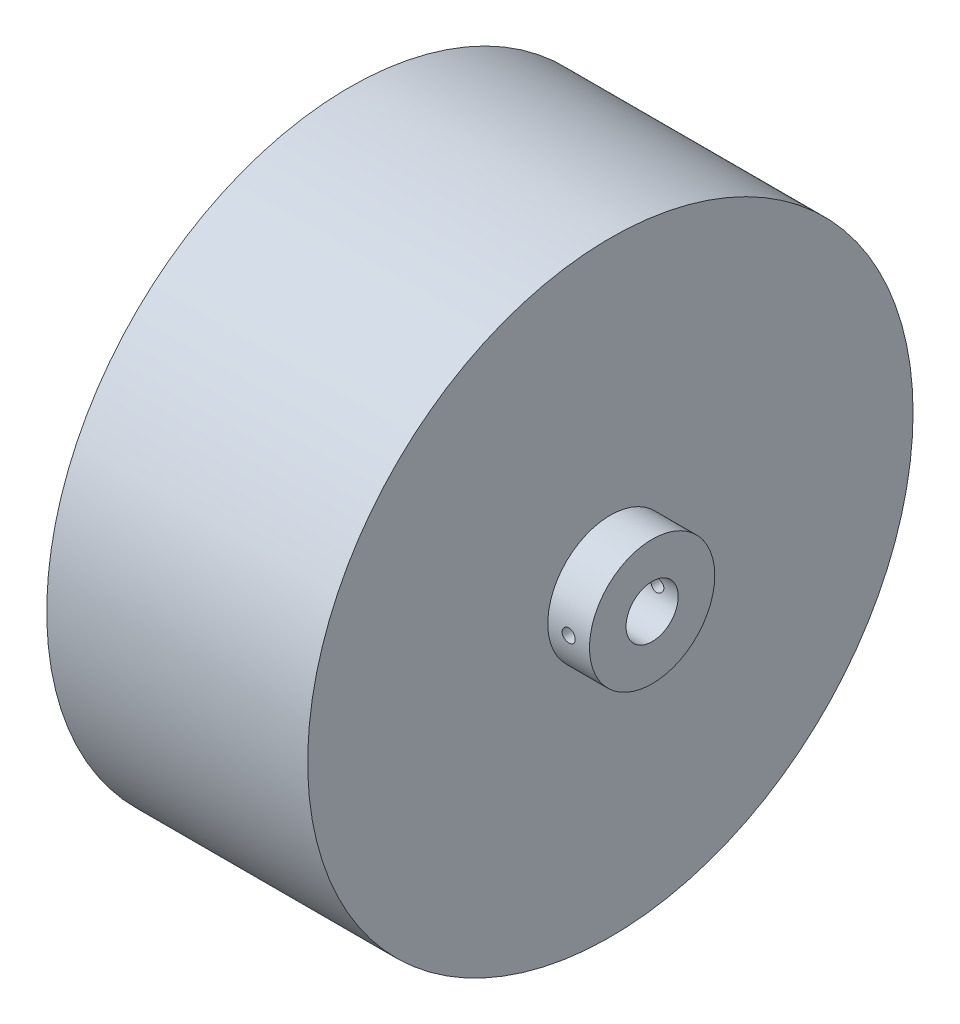
ISO-10303-21;
HEADER;
FILE_DESCRIPTION(('STEP AP214'),'2;1');
FILE_NAME('part.step','',(''),(''),'','','');
FILE_SCHEMA(('AUTOMOTIVE_DESIGN { 1 0 10303 214 1 1 1 1 }'));
ENDSEC;
DATA;
#1=APPLICATION_CONTEXT('core data for automotive mechanical design processes');
#2=APPLICATION_PROTOCOL_DEFINITION('international standard','automotive_design',2000,#1);
#3=PRODUCT_CONTEXT('',#1,'mechanical');
#4=PRODUCT('Part','Part','',(#3));
#5=PRODUCT_RELATED_PRODUCT_CATEGORY('part','',(#4));
#6=PRODUCT_DEFINITION_FORMATION('','',#4);
#7=PRODUCT_DEFINITION_CONTEXT('part definition',#1,'design');
#8=PRODUCT_DEFINITION('design','',#6,#7);
#9=PRODUCT_DEFINITION_SHAPE('','',#8);
#10=(LENGTH_UNIT() NAMED_UNIT(*) SI_UNIT(.MILLI.,.METRE.));
#11=(NAMED_UNIT(*) PLANE_ANGLE_UNIT() SI_UNIT($,.RADIAN.));
#12=(NAMED_UNIT(*) SI_UNIT($,.STERADIAN.) SOLID_ANGLE_UNIT());
#13=UNCERTAINTY_MEASURE_WITH_UNIT(LENGTH_MEASURE(1.E-05),#10,'distance_accuracy_value','');
#14=(GEOMETRIC_REPRESENTATION_CONTEXT(3) GLOBAL_UNCERTAINTY_ASSIGNED_CONTEXT((#13)) GLOBAL_UNIT_ASSIGNED_CONTEXT((#10,
#11,#12)) REPRESENTATION_CONTEXT('',''));
#15=CARTESIAN_POINT('',(0.,0.,0.));
#16=DIRECTION('',(0.,0.,1.));
#17=DIRECTION('',(1.,0.,0.));
#18=AXIS2_PLACEMENT_3D('',#15,#16,#17);
#19=CARTESIAN_POINT('',(31.75,0.,0.));
#20=DIRECTION('',(-1.,0.,0.));
#21=DIRECTION('',(0.,0.,1.));
#22=AXIS2_PLACEMENT_3D('',#19,#20,#21);
#23=CYLINDRICAL_SURFACE('',#22,36.83);
#24=CARTESIAN_POINT('',(31.75,0.,0.));
#25=DIRECTION('',(1.,0.,0.));
#26=DIRECTION('',(0.,0.,-1.));
#27=AXIS2_PLACEMENT_3D('',#24,#25,#26);
#28=CIRCLE('',#27,36.83);
#29=CARTESIAN_POINT('',(31.75,0.,-36.83));
#30=VERTEX_POINT('',#29);
#31=EDGE_CURVE('E45',#30,#30,#28,.T.);
#32=ORIENTED_EDGE('',*,*,#31,.F.);
#33=EDGE_LOOP('',(#32));
#34=FACE_BOUND('',#33,.T.);
#35=CARTESIAN_POINT('',(0.,0.,0.));
#36=DIRECTION('',(1.,0.,0.));
#37=DIRECTION('',(0.,0.,-1.));
#38=AXIS2_PLACEMENT_3D('',#35,#36,#37);
#39=CIRCLE('',#38,36.83);
#40=CARTESIAN_POINT('',(0.,0.,-36.83));
#41=VERTEX_POINT('',#40);
#42=EDGE_CURVE('E51',#41,#41,#39,.T.);
#43=ORIENTED_EDGE('',*,*,#42,.T.);
#44=EDGE_LOOP('',(#43));
#45=FACE_BOUND('',#44,.T.);
#46=ADVANCED_FACE('F37',(#34,#45),#23,.T.);
#47=CARTESIAN_POINT('',(31.75,0.,0.));
#48=DIRECTION('',(1.,0.,0.));
#49=DIRECTION('',(0.,0.,-1.));
#50=AXIS2_PLACEMENT_3D('',#47,#48,#49);
#51=PLANE('',#50);
#52=CARTESIAN_POINT('',(31.75,0.,0.));
#53=DIRECTION('',(1.,0.,0.));
#54=DIRECTION('',(0.,0.,-1.));
#55=AXIS2_PLACEMENT_3D('',#52,#53,#54);
#56=CIRCLE('',#55,7.62);
#57=CARTESIAN_POINT('',(31.75,0.,-7.62));
#58=VERTEX_POINT('',#57);
#59=EDGE_CURVE('E10',#58,#58,#56,.T.);
#60=ORIENTED_EDGE('',*,*,#59,.F.);
#61=EDGE_LOOP('',(#60));
#62=FACE_BOUND('',#61,.T.);
#63=ORIENTED_EDGE('',*,*,#31,.T.);
#64=EDGE_LOOP('',(#63));
#65=FACE_BOUND('',#64,.T.);
#66=ADVANCED_FACE('F103',(#62,#65),#51,.T.);
#67=CARTESIAN_POINT('',(0.,0.,0.));
#68=DIRECTION('',(1.,0.,0.));
#69=DIRECTION('',(0.,0.,-1.));
#70=AXIS2_PLACEMENT_3D('',#67,#68,#69);
#71=PLANE('',#70);
#72=ORIENTED_EDGE('',*,*,#42,.F.);
#73=EDGE_LOOP('',(#72));
#74=FACE_BOUND('',#73,.T.);
#75=CARTESIAN_POINT('',(0.,0.,0.));
#76=DIRECTION('',(1.,0.,0.));
#77=DIRECTION('',(0.,0.,-1.));
#78=AXIS2_PLACEMENT_3D('',#75,#76,#77);
#79=CIRCLE('',#78,3.175);
#80=CARTESIAN_POINT('',(0.,0.,-3.175));
#81=VERTEX_POINT('',#80);
#82=EDGE_CURVE('E40',#81,#81,#79,.F.);
#83=ORIENTED_EDGE('',*,*,#82,.F.);
#84=EDGE_LOOP('',(#83));
#85=FACE_BOUND('',#84,.T.);
#86=ADVANCED_FACE('F101',(#74,#85),#71,.F.);
#87=CARTESIAN_POINT('',(36.83,0.,0.));
#88=DIRECTION('',(-1.,0.,0.));
#89=DIRECTION('',(0.,0.,1.));
#90=AXIS2_PLACEMENT_3D('',#87,#88,#89);
#91=CYLINDRICAL_SURFACE('',#90,7.62);
#92=CARTESIAN_POINT('',(35.08375,0.,7.62));
#93=CARTESIAN_POINT('',(35.0837480798996,-0.0444560639248586,7.61999946932234));
#94=CARTESIAN_POINT('',(35.0800026038926,-0.0889412765303827,7.61960682623201));
#95=CARTESIAN_POINT('',(35.0651180983999,-0.176677706388215,7.61807825280323));
#96=CARTESIAN_POINT('',(35.0539709876366,-0.219927520910524,7.61694151005866));
#97=CARTESIAN_POINT('',(35.0246118467081,-0.303909992329884,7.61405301623396));
#98=CARTESIAN_POINT('',(35.0064041578639,-0.344644178198427,7.61230164313289));
#99=CARTESIAN_POINT('',(34.9634493075109,-0.422469629984459,7.60837956384624));
#100=CARTESIAN_POINT('',(34.9387034191763,-0.459561603218021,7.60620893932301));
#101=CARTESIAN_POINT('',(34.8832714224455,-0.529202658664446,7.60168194874707));
#102=CARTESIAN_POINT('',(34.8525650589263,-0.561735579913695,7.59932496606751));
#103=CARTESIAN_POINT('',(34.7861270161831,-0.621196091870419,7.59469598502292));
#104=CARTESIAN_POINT('',(34.7503951012427,-0.648123419508548,7.59242399065049));
#105=CARTESIAN_POINT('',(34.6748184421033,-0.695666119900658,7.58821597236895));
#106=CARTESIAN_POINT('',(34.634964395797,-0.716266781165265,7.58628073598548));
#107=CARTESIAN_POINT('',(34.5523391992154,-0.750477434262916,7.58297308247649));
#108=CARTESIAN_POINT('',(34.5095681268174,-0.764087612641532,7.58160065033237));
#109=CARTESIAN_POINT('',(34.4224883375713,-0.783882840087457,7.57957962928899));
#110=CARTESIAN_POINT('',(34.3781857954807,-0.79009478000049,7.57892841952593));
#111=CARTESIAN_POINT('',(34.2891625263454,-0.795000334079435,7.57841546003468));
#112=CARTESIAN_POINT('',(34.2444418112061,-0.793694161638182,7.57855368789922));
#113=CARTESIAN_POINT('',(34.1560373268632,-0.783622718419292,7.57960159121397));
#114=CARTESIAN_POINT('',(34.112350167142,-0.774886847786491,7.58050822594359));
#115=CARTESIAN_POINT('',(34.0270654475717,-0.750249752470821,7.58298604000664));
#116=CARTESIAN_POINT('',(33.9854679181172,-0.734348423596064,7.58455722900324));
#117=CARTESIAN_POINT('',(33.905450619836,-0.695799469539271,7.58819061039154));
#118=CARTESIAN_POINT('',(33.8670371600334,-0.673138841189195,7.59025374761745));
#119=CARTESIAN_POINT('',(33.7945474708059,-0.621723877286324,7.59463777461122));
#120=CARTESIAN_POINT('',(33.7604713792306,-0.592969348135541,7.59695867256681));
#121=CARTESIAN_POINT('',(33.6974529076501,-0.5300188033957,7.60161026044644));
#122=CARTESIAN_POINT('',(33.6685358770799,-0.495797404490232,7.60394094407523));
#123=CARTESIAN_POINT('',(33.6168529891196,-0.422972567940267,7.60833902109227));
#124=CARTESIAN_POINT('',(33.5940871395481,-0.384369124725994,7.61040641414588));
#125=CARTESIAN_POINT('',(33.5553537130381,-0.303858145725323,7.61404573440514));
#126=CARTESIAN_POINT('',(33.5393874678125,-0.261949964604034,7.6156175645384));
#127=CARTESIAN_POINT('',(33.514725284556,-0.176027611905661,7.61808768542704));
#128=CARTESIAN_POINT('',(33.506029110555,-0.132013508731092,7.61898599804318));
#129=CARTESIAN_POINT('',(33.4961861863831,-0.0433481852706082,7.62000505525797));
#130=CARTESIAN_POINT('',(33.4950044650832,0.00129911310945243,7.62012940172093));
#131=CARTESIAN_POINT('',(33.5001320738503,0.0901561206274336,7.61959618439866));
#132=CARTESIAN_POINT('',(33.5064412939462,0.134365836179697,7.61893863209212));
#133=CARTESIAN_POINT('',(33.5263426708419,0.220991448717849,7.61691779950452));
#134=CARTESIAN_POINT('',(33.5399184077769,0.263411158271079,7.6155561105679));
#135=CARTESIAN_POINT('',(33.5739505489925,0.345371244629689,7.61227971683757));
#136=CARTESIAN_POINT('',(33.5944071199022,0.384911551678041,7.61036499865164));
#137=CARTESIAN_POINT('',(33.6417066492181,0.460148253566468,7.60618763192398));
#138=CARTESIAN_POINT('',(33.6685725305065,0.495830167463616,7.60392374509767));
#139=CARTESIAN_POINT('',(33.7278952561504,0.562190508130547,7.5993059200501));
#140=CARTESIAN_POINT('',(33.7603522530067,0.592868798379351,7.59695197937393));
#141=CARTESIAN_POINT('',(33.8300886901385,0.648472876002174,7.59240847053422));
#142=CARTESIAN_POINT('',(33.8673865096651,0.673375676232263,7.59021958184282));
#143=CARTESIAN_POINT('',(33.9456554158947,0.716563733257792,7.58626447870772));
#144=CARTESIAN_POINT('',(33.9866264486841,0.734849087161009,7.5844982580617));
#145=CARTESIAN_POINT('',(34.0710006391959,0.764244905256942,7.5815927741327));
#146=CARTESIAN_POINT('',(34.1143990272352,0.775368937763116,7.58045232582932));
#147=CARTESIAN_POINT('',(34.20246017089,0.79017032025547,7.57892387622281));
#148=CARTESIAN_POINT('',(34.2471228868298,0.79384790365714,7.57853585133434));
#149=CARTESIAN_POINT('',(34.3362163732839,0.793648598478261,7.57855670815715));
#150=CARTESIAN_POINT('',(34.3806472298671,0.789807819268703,7.57896178076283));
#151=CARTESIAN_POINT('',(34.4682287692648,0.774756639963004,7.58051505902269));
#152=CARTESIAN_POINT('',(34.5113794508068,0.763546232541561,7.58166326541553));
#153=CARTESIAN_POINT('',(34.5951747856952,0.734084191175885,7.58457236227006));
#154=CARTESIAN_POINT('',(34.6358198526409,0.715833722956281,7.58633315129286));
#155=CARTESIAN_POINT('',(34.713475722565,0.672813304897977,7.59026921666426));
#156=CARTESIAN_POINT('',(34.7504865357906,0.648043373442265,7.59244449184414));
#157=CARTESIAN_POINT('',(34.8200083257072,0.592551734463685,7.59697695120701));
#158=CARTESIAN_POINT('',(34.8524977625092,0.561803104925515,7.59933492806508));
#159=CARTESIAN_POINT('',(34.911871156091,0.495280862712509,7.60395989523755));
#160=CARTESIAN_POINT('',(34.9387537718227,0.459506051284419,7.60622686367994));
#161=CARTESIAN_POINT('',(34.9862085571973,0.383840023622246,7.61042084212929));
#162=CARTESIAN_POINT('',(35.0067634525402,0.343937929513045,7.61234691553332));
#163=CARTESIAN_POINT('',(35.0408535219811,0.261253505822486,7.6156320489544));
#164=CARTESIAN_POINT('',(35.0543965676314,0.218474467169337,7.61699174445455));
#165=CARTESIAN_POINT('',(35.0707218208621,0.14621355259581,7.61865135700066));
#166=CARTESIAN_POINT('',(35.0756006611373,0.117192735972248,7.61915472398102));
#167=CARTESIAN_POINT('',(35.0821153781866,0.0587855276287885,7.61982922019233));
#168=CARTESIAN_POINT('',(35.0837512697772,0.0293991375797524,7.62000035094122));
#169=CARTESIAN_POINT('',(35.08375,0.,7.62));
#170=B_SPLINE_CURVE_WITH_KNOTS('',3,(#92,#93,#94,#95,#96,#97,#98,#99,#100,#101,#102,#103,#104,
#105,#106,#107,#108,#109,#110,#111,#112,#113,#114,#115,#116,#117,#118,#119,#120,#121,#122,#123,
#124,#125,#126,#127,#128,#129,#130,#131,#132,#133,#134,#135,#136,#137,#138,#139,#140,#141,#142,
#143,#144,#145,#146,#147,#148,#149,#150,#151,#152,#153,#154,#155,#156,#157,#158,#159,#160,#161,
#162,#163,#164,#165,#166,#167,#168,#169),.UNSPECIFIED.,.T.,.F.,(4,2,2,2,2,2,2,2,2,2,2,2,2,2,2,2,
2,2,2,2,2,2,2,2,2,2,2,2,2,2,2,2,2,2,2,2,2,2,4),(0.,0.133260832543641,0.266667402147008,
0.399992074100335,0.533290803041979,0.667050704215298,0.800816881298596,0.93489179195082,
1.06896312454112,1.2025456376526,1.3361243591992,1.46917694116063,1.60223145788277,
1.73554360672567,1.8688599914159,2.00281440271657,2.13676898428124,2.27074978900207,
2.40472624483891,2.53807873533664,2.6714292681726,2.80447973829187,2.93753343064907,
3.07107031800233,3.20461084822312,3.33867409785726,3.47273538009919,3.60654190754461,
3.74034424064192,3.87350552124853,4.00666693421569,4.13980630718118,4.27294530473641,
4.40669832292491,4.54048329576941,4.67463031948289,4.80862642046791,4.89675323835814,
4.98487965361084),.UNSPECIFIED.);
#171=CARTESIAN_POINT('',(35.08375,0.,7.62));
#172=VERTEX_POINT('',#171);
#173=EDGE_CURVE('E92',#172,#172,#170,.T.);
#174=ORIENTED_EDGE('',*,*,#173,.T.);
#175=EDGE_LOOP('',(#174));
#176=FACE_BOUND('',#175,.T.);
#177=CARTESIAN_POINT('',(35.08375,0.,-7.62));
#178=CARTESIAN_POINT('',(35.0837480798996,0.0444560639248586,-7.61999946932234));
#179=CARTESIAN_POINT('',(35.0800026038926,0.0889412765303827,-7.61960682623201));
#180=CARTESIAN_POINT('',(35.0651180983999,0.176677706388215,-7.61807825280323));
#181=CARTESIAN_POINT('',(35.0539709876366,0.219927520910524,-7.61694151005866));
#182=CARTESIAN_POINT('',(35.0246118467081,0.303909992329884,-7.61405301623396));
#183=CARTESIAN_POINT('',(35.0064041578639,0.344644178198427,-7.61230164313289));
#184=CARTESIAN_POINT('',(34.9634493075109,0.422469629984459,-7.60837956384624));
#185=CARTESIAN_POINT('',(34.9387034191763,0.459561603218021,-7.60620893932301));
#186=CARTESIAN_POINT('',(34.8832714224455,0.529202658664446,-7.60168194874707));
#187=CARTESIAN_POINT('',(34.8525650589263,0.561735579913695,-7.59932496606751));
#188=CARTESIAN_POINT('',(34.7861270161831,0.621196091870419,-7.59469598502292));
#189=CARTESIAN_POINT('',(34.7503951012427,0.648123419508548,-7.59242399065049));
#190=CARTESIAN_POINT('',(34.6748184421033,0.695666119900658,-7.58821597236895));
#191=CARTESIAN_POINT('',(34.634964395797,0.716266781165265,-7.58628073598548));
#192=CARTESIAN_POINT('',(34.5523391992154,0.750477434262916,-7.58297308247649));
#193=CARTESIAN_POINT('',(34.5095681268174,0.764087612641532,-7.58160065033237));
#194=CARTESIAN_POINT('',(34.4224883375713,0.783882840087457,-7.57957962928899));
#195=CARTESIAN_POINT('',(34.3781857954807,0.79009478000049,-7.57892841952593));
#196=CARTESIAN_POINT('',(34.2891625263454,0.795000334079435,-7.57841546003468));
#197=CARTESIAN_POINT('',(34.2444418112061,0.793694161638182,-7.57855368789922));
#198=CARTESIAN_POINT('',(34.1560373268632,0.783622718419292,-7.57960159121397));
#199=CARTESIAN_POINT('',(34.112350167142,0.774886847786491,-7.58050822594359));
#200=CARTESIAN_POINT('',(34.0270654475717,0.750249752470821,-7.58298604000664));
#201=CARTESIAN_POINT('',(33.9854679181172,0.734348423596064,-7.58455722900324));
#202=CARTESIAN_POINT('',(33.905450619836,0.695799469539271,-7.58819061039154));
#203=CARTESIAN_POINT('',(33.8670371600334,0.673138841189195,-7.59025374761745));
#204=CARTESIAN_POINT('',(33.7945474708059,0.621723877286324,-7.59463777461122));
#205=CARTESIAN_POINT('',(33.7604713792306,0.592969348135541,-7.59695867256681));
#206=CARTESIAN_POINT('',(33.6974529076501,0.5300188033957,-7.60161026044644));
#207=CARTESIAN_POINT('',(33.6685358770799,0.495797404490232,-7.60394094407523));
#208=CARTESIAN_POINT('',(33.6168529891196,0.422972567940267,-7.60833902109227));
#209=CARTESIAN_POINT('',(33.5940871395481,0.384369124725994,-7.61040641414588));
#210=CARTESIAN_POINT('',(33.5553537130381,0.303858145725323,-7.61404573440514));
#211=CARTESIAN_POINT('',(33.5393874678125,0.261949964604034,-7.6156175645384));
#212=CARTESIAN_POINT('',(33.514725284556,0.176027611905661,-7.61808768542704));
#213=CARTESIAN_POINT('',(33.506029110555,0.132013508731092,-7.61898599804318));
#214=CARTESIAN_POINT('',(33.4961861863831,0.0433481852706082,-7.62000505525797));
#215=CARTESIAN_POINT('',(33.4950044650832,-0.00129911310945243,-7.62012940172093));
#216=CARTESIAN_POINT('',(33.5001320738503,-0.0901561206274336,-7.61959618439866));
#217=CARTESIAN_POINT('',(33.5064412939462,-0.134365836179697,-7.61893863209212));
#218=CARTESIAN_POINT('',(33.5263426708419,-0.220991448717849,-7.61691779950452));
#219=CARTESIAN_POINT('',(33.5399184077769,-0.263411158271079,-7.6155561105679));
#220=CARTESIAN_POINT('',(33.5739505489925,-0.345371244629689,-7.61227971683757));
#221=CARTESIAN_POINT('',(33.5944071199022,-0.384911551678041,-7.61036499865164));
#222=CARTESIAN_POINT('',(33.6417066492181,-0.460148253566468,-7.60618763192398));
#223=CARTESIAN_POINT('',(33.6685725305065,-0.495830167463616,-7.60392374509767));
#224=CARTESIAN_POINT('',(33.7278952561504,-0.562190508130547,-7.5993059200501));
#225=CARTESIAN_POINT('',(33.7603522530067,-0.592868798379351,-7.59695197937393));
#226=CARTESIAN_POINT('',(33.8300886901385,-0.648472876002174,-7.59240847053422));
#227=CARTESIAN_POINT('',(33.8673865096651,-0.673375676232263,-7.59021958184282));
#228=CARTESIAN_POINT('',(33.9456554158947,-0.716563733257792,-7.58626447870772));
#229=CARTESIAN_POINT('',(33.9866264486841,-0.734849087161009,-7.5844982580617));
#230=CARTESIAN_POINT('',(34.0710006391959,-0.764244905256942,-7.5815927741327));
#231=CARTESIAN_POINT('',(34.1143990272352,-0.775368937763116,-7.58045232582932));
#232=CARTESIAN_POINT('',(34.20246017089,-0.79017032025547,-7.57892387622281));
#233=CARTESIAN_POINT('',(34.2471228868298,-0.79384790365714,-7.57853585133434));
#234=CARTESIAN_POINT('',(34.3362163732839,-0.793648598478261,-7.57855670815715));
#235=CARTESIAN_POINT('',(34.3806472298671,-0.789807819268703,-7.57896178076283));
#236=CARTESIAN_POINT('',(34.4682287692648,-0.774756639963004,-7.58051505902269));
#237=CARTESIAN_POINT('',(34.5113794508068,-0.763546232541561,-7.58166326541553));
#238=CARTESIAN_POINT('',(34.5951747856952,-0.734084191175885,-7.58457236227006));
#239=CARTESIAN_POINT('',(34.6358198526409,-0.715833722956281,-7.58633315129286));
#240=CARTESIAN_POINT('',(34.713475722565,-0.672813304897977,-7.59026921666426));
#241=CARTESIAN_POINT('',(34.7504865357906,-0.648043373442265,-7.59244449184414));
#242=CARTESIAN_POINT('',(34.8200083257072,-0.592551734463685,-7.59697695120701));
#243=CARTESIAN_POINT('',(34.8524977625092,-0.561803104925515,-7.59933492806508));
#244=CARTESIAN_POINT('',(34.911871156091,-0.495280862712509,-7.60395989523755));
#245=CARTESIAN_POINT('',(34.9387537718227,-0.459506051284419,-7.60622686367994));
#246=CARTESIAN_POINT('',(34.9862085571973,-0.383840023622246,-7.61042084212929));
#247=CARTESIAN_POINT('',(35.0067634525402,-0.343937929513045,-7.61234691553332));
#248=CARTESIAN_POINT('',(35.0408535219811,-0.261253505822486,-7.6156320489544));
#249=CARTESIAN_POINT('',(35.0543965676314,-0.218474467169337,-7.61699174445455));
#250=CARTESIAN_POINT('',(35.0707218208621,-0.14621355259581,-7.61865135700066));
#251=CARTESIAN_POINT('',(35.0756006611373,-0.117192735972248,-7.61915472398102));
#252=CARTESIAN_POINT('',(35.0821153781866,-0.0587855276287885,-7.61982922019233));
#253=CARTESIAN_POINT('',(35.0837512697772,-0.0293991375797524,-7.62000035094122));
#254=CARTESIAN_POINT('',(35.08375,0.,-7.62));
#255=B_SPLINE_CURVE_WITH_KNOTS('',3,(#177,#178,#179,#180,#181,#182,#183,#184,#185,#186,#187,
#188,#189,#190,#191,#192,#193,#194,#195,#196,#197,#198,#199,#200,#201,#202,#203,#204,#205,#206,
#207,#208,#209,#210,#211,#212,#213,#214,#215,#216,#217,#218,#219,#220,#221,#222,#223,#224,#225,
#226,#227,#228,#229,#230,#231,#232,#233,#234,#235,#236,#237,#238,#239,#240,#241,#242,#243,#244,
#245,#246,#247,#248,#249,#250,#251,#252,#253,#254),.UNSPECIFIED.,.T.,.F.,(4,2,2,2,2,2,2,2,2,2,2,
2,2,2,2,2,2,2,2,2,2,2,2,2,2,2,2,2,2,2,2,2,2,2,2,2,2,2,4),(0.,0.133260832543641,
0.266667402147008,0.399992074100335,0.533290803041979,0.667050704215298,0.800816881298596,
0.93489179195082,1.06896312454112,1.2025456376526,1.3361243591992,1.46917694116063,
1.60223145788277,1.73554360672567,1.8688599914159,2.00281440271657,2.13676898428124,
2.27074978900207,2.40472624483891,2.53807873533664,2.6714292681726,2.80447973829187,
2.93753343064907,3.07107031800233,3.20461084822312,3.33867409785726,3.47273538009919,
3.60654190754461,3.74034424064192,3.87350552124853,4.00666693421569,4.13980630718118,
4.27294530473641,4.40669832292491,4.54048329576941,4.67463031948289,4.80862642046791,
4.89675323835814,4.98487965361084),.UNSPECIFIED.);
#256=CARTESIAN_POINT('',(35.08375,0.,-7.62));
#257=VERTEX_POINT('',#256);
#258=EDGE_CURVE('E85',#257,#257,#255,.T.);
#259=ORIENTED_EDGE('',*,*,#258,.T.);
#260=EDGE_LOOP('',(#259));
#261=FACE_BOUND('',#260,.T.);
#262=CARTESIAN_POINT('',(36.83,0.,0.));
#263=DIRECTION('',(1.,0.,0.));
#264=DIRECTION('',(0.,0.,-1.));
#265=AXIS2_PLACEMENT_3D('',#262,#263,#264);
#266=CIRCLE('',#265,7.62);
#267=CARTESIAN_POINT('',(36.83,0.,-7.62));
#268=VERTEX_POINT('',#267);
#269=EDGE_CURVE('E54',#268,#268,#266,.T.);
#270=ORIENTED_EDGE('',*,*,#269,.F.);
#271=EDGE_LOOP('',(#270));
#272=FACE_BOUND('',#271,.T.);
#273=ORIENTED_EDGE('',*,*,#59,.T.);
#274=EDGE_LOOP('',(#273));
#275=FACE_BOUND('',#274,.T.);
#276=ADVANCED_FACE('F96',(#176,#261,#272,#275),#91,.T.);
#277=CARTESIAN_POINT('',(36.83,0.,0.));
#278=DIRECTION('',(1.,0.,0.));
#279=DIRECTION('',(0.,0.,-1.));
#280=AXIS2_PLACEMENT_3D('',#277,#278,#279);
#281=PLANE('',#280);
#282=CARTESIAN_POINT('',(36.83,0.,0.));
#283=DIRECTION('',(1.,0.,0.));
#284=DIRECTION('',(0.,0.,-1.));
#285=AXIS2_PLACEMENT_3D('',#282,#283,#284);
#286=CIRCLE('',#285,3.175);
#287=CARTESIAN_POINT('',(36.83,0.,-3.175));
#288=VERTEX_POINT('',#287);
#289=EDGE_CURVE('E181',#288,#288,#286,.T.);
#290=ORIENTED_EDGE('',*,*,#289,.F.);
#291=EDGE_LOOP('',(#290));
#292=FACE_BOUND('',#291,.T.);
#293=ORIENTED_EDGE('',*,*,#269,.T.);
#294=EDGE_LOOP('',(#293));
#295=FACE_BOUND('',#294,.T.);
#296=ADVANCED_FACE('F100',(#292,#295),#281,.T.);
#297=CARTESIAN_POINT('',(-5.08,0.,0.));
#298=DIRECTION('',(1.,0.,0.));
#299=DIRECTION('',(0.,0.,-1.));
#300=AXIS2_PLACEMENT_3D('',#297,#298,#299);
#301=CYLINDRICAL_SURFACE('',#300,3.175);
#302=ORIENTED_EDGE('',*,*,#82,.T.);
#303=EDGE_LOOP('',(#302));
#304=FACE_BOUND('',#303,.T.);
#305=CARTESIAN_POINT('',(33.49625,0.,-3.175));
#306=CARTESIAN_POINT('',(33.4962512307031,0.0438552635877323,-3.17499925846823));
#307=CARTESIAN_POINT('',(33.4998967789511,0.0877242751854447,-3.17408230928092));
#308=CARTESIAN_POINT('',(33.5143608092333,0.17420501299524,-3.17051326901651));
#309=CARTESIAN_POINT('',(33.5251833567138,0.216816012302433,-3.167860194514));
#310=CARTESIAN_POINT('',(33.5536324382904,0.299519378196614,-3.16111268934038));
#311=CARTESIAN_POINT('',(33.5712508018202,0.339614702315042,-3.15701999003938));
#312=CARTESIAN_POINT('',(33.6127626522321,0.416280669799425,-3.14782911098185));
#313=CARTESIAN_POINT('',(33.6366563507796,0.452851194217886,-3.14273089731102));
#314=CARTESIAN_POINT('',(33.6905604178587,0.52218268653007,-3.13196506358995));
#315=CARTESIAN_POINT('',(33.7206757084159,0.554860719323982,-3.12628865866099));
#316=CARTESIAN_POINT('',(33.785943458431,0.614758807311746,-3.11506457312193));
#317=CARTESIAN_POINT('',(33.8210964858925,0.641978246218916,-3.10951690710918));
#318=CARTESIAN_POINT('',(33.8960858074819,0.690576545564488,-3.0990898547443));
#319=CARTESIAN_POINT('',(33.9359839179705,0.711862630927167,-3.09422162074028));
#320=CARTESIAN_POINT('',(34.0189335345025,0.747393364107987,-3.08583274338135));
#321=CARTESIAN_POINT('',(34.0619845351349,0.76163913766998,-3.08231188460184));
#322=CARTESIAN_POINT('',(34.1491059344655,0.782401934475603,-3.07710668929704));
#323=CARTESIAN_POINT('',(34.193138632493,0.789068075326392,-3.07538697360746));
#324=CARTESIAN_POINT('',(34.2817283677699,0.794946855973405,-3.07387287676221));
#325=CARTESIAN_POINT('',(34.3262853185363,0.794160708378679,-3.07407818237407));
#326=CARTESIAN_POINT('',(34.4135158649315,0.785276202621619,-3.07635912908627));
#327=CARTESIAN_POINT('',(34.4562089330253,0.777355538350816,-3.07838931671828));
#328=CARTESIAN_POINT('',(34.5396402227739,0.754710298902893,-3.08401883870473));
#329=CARTESIAN_POINT('',(34.5803783049362,0.739985239011736,-3.08761828484493));
#330=CARTESIAN_POINT('',(34.6592197002667,0.70399776540841,-3.09602247774299));
#331=CARTESIAN_POINT('',(34.6972922659053,0.682670861410747,-3.10083902452569));
#332=CARTESIAN_POINT('',(34.769381983913,0.634130196057911,-3.11112805322879));
#333=CARTESIAN_POINT('',(34.8033984250189,0.606915404578009,-3.11660064985464));
#334=CARTESIAN_POINT('',(34.8674285799716,0.546451062227143,-3.12777653452301));
#335=CARTESIAN_POINT('',(34.8973005009908,0.513051561612766,-3.1334819509876));
#336=CARTESIAN_POINT('',(34.9510462408038,0.441648806345707,-3.14433990118774));
#337=CARTESIAN_POINT('',(34.9749198763811,0.403645411120453,-3.14949241803232));
#338=CARTESIAN_POINT('',(35.0160434352104,0.323911324427236,-3.15868966566505));
#339=CARTESIAN_POINT('',(35.0332703258846,0.282168278906229,-3.16273053067588));
#340=CARTESIAN_POINT('',(35.0604229076047,0.196255220975607,-3.16922106074626));
#341=CARTESIAN_POINT('',(35.0703499952713,0.152085674550463,-3.17167103017036));
#342=CARTESIAN_POINT('',(35.0824046284415,0.0637857343313875,-3.17465868364436));
#343=CARTESIAN_POINT('',(35.0847252679648,0.0196832643270929,-3.17524369981464));
#344=CARTESIAN_POINT('',(35.0820307364123,-0.0682798962491324,-3.17457034214314));
#345=CARTESIAN_POINT('',(35.0770162256855,-0.112140608228599,-3.1733121342381));
#346=CARTESIAN_POINT('',(35.0599528943096,-0.197704217227561,-3.1691240334656));
#347=CARTESIAN_POINT('',(35.0480094147434,-0.239429458787633,-3.16621918923325));
#348=CARTESIAN_POINT('',(35.0175475013683,-0.320281983922788,-3.15906523927229));
#349=CARTESIAN_POINT('',(34.9990284035509,-0.35940900465477,-3.15481599779068));
#350=CARTESIAN_POINT('',(34.9555667151371,-0.434722658635794,-3.14533125444339));
#351=CARTESIAN_POINT('',(34.9305159738567,-0.470844796304793,-3.14007958981668));
#352=CARTESIAN_POINT('',(34.8748403399283,-0.538441166386217,-3.12919802778343));
#353=CARTESIAN_POINT('',(34.8442144852861,-0.56991459495655,-3.12356806520694));
#354=CARTESIAN_POINT('',(34.7773614623865,-0.628115842271821,-3.11239406391741));
#355=CARTESIAN_POINT('',(34.7410152571612,-0.654708213283326,-3.10685552632436));
#356=CARTESIAN_POINT('',(34.6642623142619,-0.701416109977553,-3.09664564807955));
#357=CARTESIAN_POINT('',(34.6238557569338,-0.721531923158575,-3.09197426893801));
#358=CARTESIAN_POINT('',(34.5403457218898,-0.754565960072417,-3.0840790846376));
#359=CARTESIAN_POINT('',(34.4972599633346,-0.767526826562776,-3.08084672591967));
#360=CARTESIAN_POINT('',(34.409427816617,-0.785995411725541,-3.07618735414389));
#361=CARTESIAN_POINT('',(34.3646817938286,-0.791504760374123,-3.07475994626799));
#362=CARTESIAN_POINT('',(34.2761776248766,-0.794828754051739,-3.0739021855376));
#363=CARTESIAN_POINT('',(34.2324280239132,-0.792859887575313,-3.07441564402039));
#364=CARTESIAN_POINT('',(34.1459058589132,-0.781778809773891,-3.07725185183317));
#365=CARTESIAN_POINT('',(34.1031332752594,-0.77266674200508,-3.07957456480274));
#366=CARTESIAN_POINT('',(34.0200146904112,-0.747676156538477,-3.08573625444607));
#367=CARTESIAN_POINT('',(33.9796557593104,-0.731838243310032,-3.08956612229214));
#368=CARTESIAN_POINT('',(33.9021391516473,-0.693877683449351,-3.09831187404388));
#369=CARTESIAN_POINT('',(33.8649819200219,-0.671754165143092,-3.10322790855576));
#370=CARTESIAN_POINT('',(33.7938773421531,-0.621171683653816,-3.11375231464442));
#371=CARTESIAN_POINT('',(33.7600390153132,-0.592562507041065,-3.11937540140138));
#372=CARTESIAN_POINT('',(33.6975730221291,-0.530113542254564,-3.1305924775116));
#373=CARTESIAN_POINT('',(33.6689465948986,-0.496272513750685,-3.13618645963902));
#374=CARTESIAN_POINT('',(33.6172115158846,-0.423580764630116,-3.14683592780222));
#375=CARTESIAN_POINT('',(33.5942121835988,-0.384650415142417,-3.15187982656105));
#376=CARTESIAN_POINT('',(33.555121134194,-0.30335328982429,-3.16073856132667));
#377=CARTESIAN_POINT('',(33.5390244674902,-0.260989002318606,-3.16455427751551));
#378=CARTESIAN_POINT('',(33.5165849064506,-0.182250425674669,-3.16996264853432));
#379=CARTESIAN_POINT('',(33.5089758005509,-0.146251173772184,-3.17183867923715));
#380=CARTESIAN_POINT('',(33.4988080215001,-0.0735044628546153,-3.17435761935239));
#381=CARTESIAN_POINT('',(33.4962489684926,-0.0367570603242172,-3.17500062151098));
#382=CARTESIAN_POINT('',(33.49625,0.,-3.175));
#383=B_SPLINE_CURVE_WITH_KNOTS('',3,(#305,#306,#307,#308,#309,#310,#311,#312,#313,#314,#315,
#316,#317,#318,#319,#320,#321,#322,#323,#324,#325,#326,#327,#328,#329,#330,#331,#332,#333,#334,
#335,#336,#337,#338,#339,#340,#341,#342,#343,#344,#345,#346,#347,#348,#349,#350,#351,#352,#353,
#354,#355,#356,#357,#358,#359,#360,#361,#362,#363,#364,#365,#366,#367,#368,#369,#370,#371,#372,
#373,#374,#375,#376,#377,#378,#379,#380,#381,#382),.UNSPECIFIED.,.T.,.F.,(4,2,2,2,2,2,2,2,2,2,2,
2,2,2,2,2,2,2,2,2,2,2,2,2,2,2,2,2,2,2,2,2,2,2,2,2,2,2,4),(0.,0.131431089516374,
0.262936692483398,0.394284677459732,0.525637093339603,0.659418054188188,0.793214110694492,
0.928997843263226,1.06475985702125,1.19780206156782,1.33082261834635,1.46061904666214,
1.59042472250779,1.72154070999928,1.85267965567469,1.98755794262773,2.12244034891239,
2.25778604517323,2.39310583993574,2.52496271818992,2.6568077267216,2.78669895263678,
2.91660329874712,3.04881273419999,3.18104500425077,3.31652302787369,3.45199503671614,
3.58665068066594,3.72127686471065,3.85203583794266,3.98279218339235,4.11277011962707,
4.24276608972443,4.37615317516911,4.50957193170179,4.64540698160199,4.78114446688798,
4.89131103556887,5.00146931739441),.UNSPECIFIED.);
#384=CARTESIAN_POINT('',(33.49625,0.,-3.175));
#385=VERTEX_POINT('',#384);
#386=EDGE_CURVE('E68',#385,#385,#383,.T.);
#387=ORIENTED_EDGE('',*,*,#386,.T.);
#388=EDGE_LOOP('',(#387));
#389=FACE_BOUND('',#388,.T.);
#390=CARTESIAN_POINT('',(35.08375,0.,3.175));
#391=CARTESIAN_POINT('',(35.0837487692969,0.0438552635877323,3.17499925846823));
#392=CARTESIAN_POINT('',(35.0801032210489,0.0877242751854447,3.17408230928092));
#393=CARTESIAN_POINT('',(35.0656391907667,0.17420501299524,3.17051326901651));
#394=CARTESIAN_POINT('',(35.0548166432862,0.216816012302433,3.167860194514));
#395=CARTESIAN_POINT('',(35.0263675617096,0.299519378196614,3.16111268934038));
#396=CARTESIAN_POINT('',(35.0087491981798,0.339614702315042,3.15701999003938));
#397=CARTESIAN_POINT('',(34.9672373477679,0.416280669799425,3.14782911098185));
#398=CARTESIAN_POINT('',(34.9433436492204,0.452851194217886,3.14273089731102));
#399=CARTESIAN_POINT('',(34.8894395821413,0.52218268653007,3.13196506358995));
#400=CARTESIAN_POINT('',(34.8593242915841,0.554860719323982,3.12628865866099));
#401=CARTESIAN_POINT('',(34.794056541569,0.614758807311746,3.11506457312193));
#402=CARTESIAN_POINT('',(34.7589035141075,0.641978246218916,3.10951690710918));
#403=CARTESIAN_POINT('',(34.6839141925181,0.690576545564488,3.0990898547443));
#404=CARTESIAN_POINT('',(34.6440160820295,0.711862630927167,3.09422162074028));
#405=CARTESIAN_POINT('',(34.5610664654975,0.747393364107987,3.08583274338135));
#406=CARTESIAN_POINT('',(34.5180154648651,0.76163913766998,3.08231188460184));
#407=CARTESIAN_POINT('',(34.4308940655345,0.782401934475603,3.07710668929704));
#408=CARTESIAN_POINT('',(34.386861367507,0.789068075326392,3.07538697360746));
#409=CARTESIAN_POINT('',(34.2982716322301,0.794946855973405,3.07387287676221));
#410=CARTESIAN_POINT('',(34.2537146814637,0.794160708378679,3.07407818237407));
#411=CARTESIAN_POINT('',(34.1664841350685,0.785276202621619,3.07635912908627));
#412=CARTESIAN_POINT('',(34.1237910669747,0.777355538350817,3.07838931671828));
#413=CARTESIAN_POINT('',(34.0403597772261,0.754710298902894,3.08401883870473));
#414=CARTESIAN_POINT('',(33.9996216950638,0.739985239011737,3.08761828484493));
#415=CARTESIAN_POINT('',(33.9207802997333,0.70399776540841,3.09602247774299));
#416=CARTESIAN_POINT('',(33.8827077340947,0.682670861410747,3.10083902452569));
#417=CARTESIAN_POINT('',(33.810618016087,0.63413019605791,3.11112805322879));
#418=CARTESIAN_POINT('',(33.7766015749811,0.606915404578008,3.11660064985464));
#419=CARTESIAN_POINT('',(33.7125714200284,0.546451062227144,3.12777653452301));
#420=CARTESIAN_POINT('',(33.6826994990092,0.513051561612768,3.1334819509876));
#421=CARTESIAN_POINT('',(33.6289537591962,0.441648806345709,3.14433990118774));
#422=CARTESIAN_POINT('',(33.6050801236189,0.403645411120454,3.14949241803232));
#423=CARTESIAN_POINT('',(33.5639565647896,0.323911324427235,3.15868966566505));
#424=CARTESIAN_POINT('',(33.5467296741154,0.282168278906229,3.16273053067588));
#425=CARTESIAN_POINT('',(33.5195770923954,0.196255220975607,3.16922106074626));
#426=CARTESIAN_POINT('',(33.5096500047287,0.152085674550463,3.17167103017036));
#427=CARTESIAN_POINT('',(33.4975953715585,0.0637857343313875,3.17465868364436));
#428=CARTESIAN_POINT('',(33.4952747320352,0.0196832643270929,3.17524369981464));
#429=CARTESIAN_POINT('',(33.4979692635877,-0.0682798962491324,3.17457034214314));
#430=CARTESIAN_POINT('',(33.5029837743145,-0.112140608228599,3.1733121342381));
#431=CARTESIAN_POINT('',(33.5200471056904,-0.197704217227561,3.1691240334656));
#432=CARTESIAN_POINT('',(33.5319905852566,-0.239429458787633,3.16621918923325));
#433=CARTESIAN_POINT('',(33.5624524986317,-0.320281983922788,3.15906523927229));
#434=CARTESIAN_POINT('',(33.5809715964491,-0.359409004654769,3.15481599779068));
#435=CARTESIAN_POINT('',(33.6244332848629,-0.434722658635795,3.14533125444339));
#436=CARTESIAN_POINT('',(33.6494840261433,-0.470844796304796,3.14007958981668));
#437=CARTESIAN_POINT('',(33.7051596600717,-0.53844116638622,3.12919802778343));
#438=CARTESIAN_POINT('',(33.7357855147139,-0.569914594956551,3.12356806520694));
#439=CARTESIAN_POINT('',(33.8026385376135,-0.62811584227182,3.11239406391741));
#440=CARTESIAN_POINT('',(33.8389847428388,-0.654708213283326,3.10685552632436));
#441=CARTESIAN_POINT('',(33.9157376857381,-0.701416109977553,3.09664564807955));
#442=CARTESIAN_POINT('',(33.9561442430662,-0.721531923158575,3.09197426893801));
#443=CARTESIAN_POINT('',(34.0396542781103,-0.754565960072417,3.0840790846376));
#444=CARTESIAN_POINT('',(34.0827400366654,-0.767526826562776,3.08084672591967));
#445=CARTESIAN_POINT('',(34.170572183383,-0.785995411725541,3.07618735414389));
#446=CARTESIAN_POINT('',(34.2153182061714,-0.791504760374123,3.07475994626799));
#447=CARTESIAN_POINT('',(34.3038223751234,-0.794828754051739,3.0739021855376));
#448=CARTESIAN_POINT('',(34.3475719760868,-0.792859887575312,3.07441564402039));
#449=CARTESIAN_POINT('',(34.4340941410868,-0.781778809773891,3.07725185183317));
#450=CARTESIAN_POINT('',(34.4768667247406,-0.772666742005081,3.07957456480274));
#451=CARTESIAN_POINT('',(34.5599853095888,-0.747676156538476,3.08573625444607));
#452=CARTESIAN_POINT('',(34.6003442406896,-0.73183824331003,3.08956612229214));
#453=CARTESIAN_POINT('',(34.6778608483527,-0.693877683449349,3.09831187404388));
#454=CARTESIAN_POINT('',(34.7150180799781,-0.671754165143091,3.10322790855576));
#455=CARTESIAN_POINT('',(34.7861226578469,-0.621171683653818,3.11375231464442));
#456=CARTESIAN_POINT('',(34.8199609846868,-0.592562507041067,3.11937540140138));
#457=CARTESIAN_POINT('',(34.8824269778709,-0.530113542254566,3.1305924775116));
#458=CARTESIAN_POINT('',(34.9110534051014,-0.496272513750686,3.13618645963902));
#459=CARTESIAN_POINT('',(34.9627884841154,-0.423580764630116,3.14683592780222));
#460=CARTESIAN_POINT('',(34.9857878164012,-0.384650415142417,3.15187982656105));
#461=CARTESIAN_POINT('',(35.024878865806,-0.30335328982429,3.16073856132667));
#462=CARTESIAN_POINT('',(35.0409755325098,-0.260989002318606,3.16455427751551));
#463=CARTESIAN_POINT('',(35.0634150935494,-0.182250425674669,3.16996264853432));
#464=CARTESIAN_POINT('',(35.0710241994491,-0.146251173772184,3.17183867923715));
#465=CARTESIAN_POINT('',(35.0811919784999,-0.0735044628546153,3.17435761935239));
#466=CARTESIAN_POINT('',(35.0837510315074,-0.0367570603242172,3.17500062151098));
#467=CARTESIAN_POINT('',(35.08375,0.,3.175));
#468=B_SPLINE_CURVE_WITH_KNOTS('',3,(#390,#391,#392,#393,#394,#395,#396,#397,#398,#399,#400,
#401,#402,#403,#404,#405,#406,#407,#408,#409,#410,#411,#412,#413,#414,#415,#416,#417,#418,#419,
#420,#421,#422,#423,#424,#425,#426,#427,#428,#429,#430,#431,#432,#433,#434,#435,#436,#437,#438,
#439,#440,#441,#442,#443,#444,#445,#446,#447,#448,#449,#450,#451,#452,#453,#454,#455,#456,#457,
#458,#459,#460,#461,#462,#463,#464,#465,#466,#467),.UNSPECIFIED.,.T.,.F.,(4,2,2,2,2,2,2,2,2,2,2,
2,2,2,2,2,2,2,2,2,2,2,2,2,2,2,2,2,2,2,2,2,2,2,2,2,2,2,4),(0.,0.131431089516374,
0.262936692483398,0.394284677459732,0.525637093339603,0.659418054188188,0.793214110694492,
0.928997843263226,1.06475985702125,1.19780206156782,1.33082261834635,1.46061904666214,
1.59042472250779,1.72154070999928,1.85267965567469,1.98755794262773,2.12244034891239,
2.25778604517323,2.39310583993574,2.52496271818992,2.6568077267216,2.78669895263678,
2.91660329874712,3.04881273419999,3.18104500425077,3.31652302787369,3.45199503671614,
3.58665068066594,3.72127686471065,3.85203583794266,3.98279218339235,4.11277011962707,
4.24276608972443,4.37615317516911,4.50957193170179,4.64540698160199,4.78114446688798,
4.89131103556887,5.00146931739441),.UNSPECIFIED.);
#469=CARTESIAN_POINT('',(35.08375,0.,3.175));
#470=VERTEX_POINT('',#469);
#471=EDGE_CURVE('E60',#470,#470,#468,.T.);
#472=ORIENTED_EDGE('',*,*,#471,.T.);
#473=EDGE_LOOP('',(#472));
#474=FACE_BOUND('',#473,.T.);
#475=ORIENTED_EDGE('',*,*,#289,.T.);
#476=EDGE_LOOP('',(#475));
#477=FACE_BOUND('',#476,.T.);
#478=ADVANCED_FACE('F72',(#304,#389,#474,#477),#301,.F.);
#479=CARTESIAN_POINT('',(34.29,0.,-36.83));
#480=DIRECTION('',(0.,0.,1.));
#481=DIRECTION('',(1.,0.,0.));
#482=AXIS2_PLACEMENT_3D('',#479,#480,#481);
#483=CYLINDRICAL_SURFACE('',#482,0.79375);
#484=ORIENTED_EDGE('',*,*,#471,.F.);
#485=EDGE_LOOP('',(#484));
#486=FACE_BOUND('',#485,.T.);
#487=ORIENTED_EDGE('',*,*,#173,.F.);
#488=EDGE_LOOP('',(#487));
#489=FACE_BOUND('',#488,.T.);
#490=ADVANCED_FACE('F75',(#486,#489),#483,.F.);
#491=ORIENTED_EDGE('',*,*,#386,.F.);
#492=EDGE_LOOP('',(#491));
#493=FACE_BOUND('',#492,.T.);
#494=ORIENTED_EDGE('',*,*,#258,.F.);
#495=EDGE_LOOP('',(#494));
#496=FACE_BOUND('',#495,.T.);
#497=ADVANCED_FACE('F78',(#493,#496),#483,.F.);
#498=CLOSED_SHELL('',(#46,#66,#86,#276,#296,#478,#490,#497));
#499=MANIFOLD_SOLID_BREP('B2',#498);
#500=ADVANCED_BREP_SHAPE_REPRESENTATION('',(#18,#499),#14);
#501=SHAPE_DEFINITION_REPRESENTATION(#9,#500);
ENDSEC;
END-ISO-10303-21;
